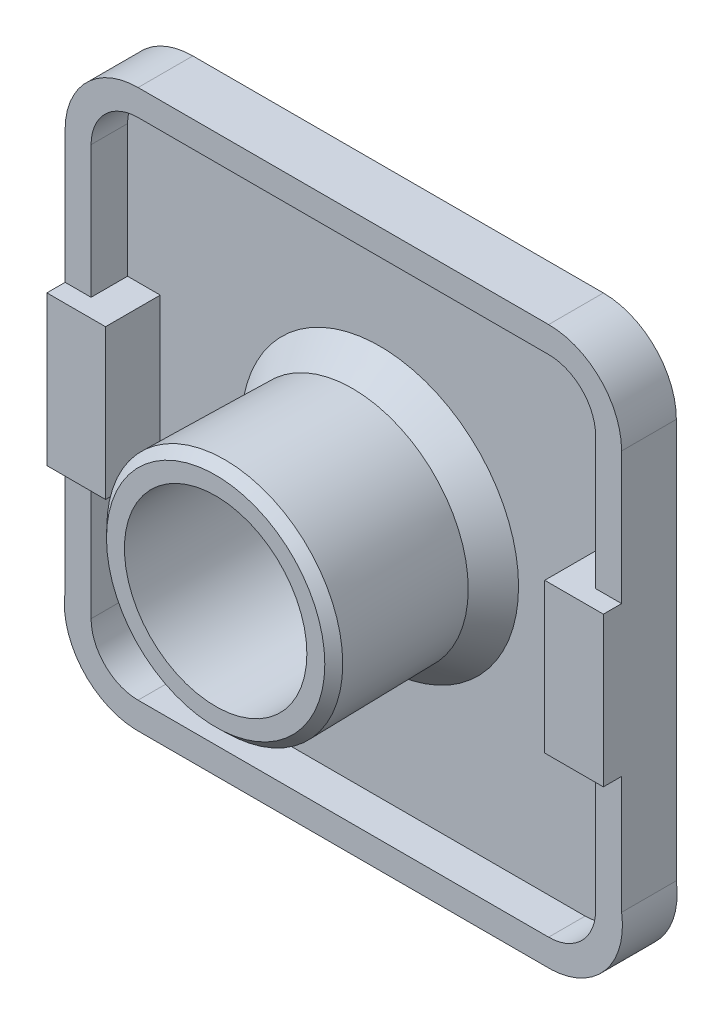
ISO-10303-21;
HEADER;
FILE_DESCRIPTION(('STEP AP214'),'2;1');
FILE_NAME('part.step','',(''),(''),'','','');
FILE_SCHEMA(('AUTOMOTIVE_DESIGN { 1 0 10303 214 1 1 1 1 }'));
ENDSEC;
DATA;
#1=APPLICATION_CONTEXT('core data for automotive mechanical design processes');
#2=APPLICATION_PROTOCOL_DEFINITION('international standard','automotive_design',2000,#1);
#3=PRODUCT_CONTEXT('',#1,'mechanical');
#4=PRODUCT('Part','Part','',(#3));
#5=PRODUCT_RELATED_PRODUCT_CATEGORY('part','',(#4));
#6=PRODUCT_DEFINITION_FORMATION('','',#4);
#7=PRODUCT_DEFINITION_CONTEXT('part definition',#1,'design');
#8=PRODUCT_DEFINITION('design','',#6,#7);
#9=PRODUCT_DEFINITION_SHAPE('','',#8);
#10=(LENGTH_UNIT() NAMED_UNIT(*) SI_UNIT(.MILLI.,.METRE.));
#11=(NAMED_UNIT(*) PLANE_ANGLE_UNIT() SI_UNIT($,.RADIAN.));
#12=(NAMED_UNIT(*) SI_UNIT($,.STERADIAN.) SOLID_ANGLE_UNIT());
#13=UNCERTAINTY_MEASURE_WITH_UNIT(LENGTH_MEASURE(1.E-05),#10,'distance_accuracy_value','');
#14=(GEOMETRIC_REPRESENTATION_CONTEXT(3) GLOBAL_UNCERTAINTY_ASSIGNED_CONTEXT((#13)) GLOBAL_UNIT_ASSIGNED_CONTEXT((#10,
#11,#12)) REPRESENTATION_CONTEXT('',''));
#15=CARTESIAN_POINT('',(0.,0.,0.));
#16=DIRECTION('',(0.,0.,1.));
#17=DIRECTION('',(1.,0.,0.));
#18=AXIS2_PLACEMENT_3D('',#15,#16,#17);
#19=CARTESIAN_POINT('',(0.,0.,3.));
#20=DIRECTION('',(0.,0.,1.));
#21=DIRECTION('',(1.,0.,0.));
#22=AXIS2_PLACEMENT_3D('',#19,#20,#21);
#23=PLANE('',#22);
#24=DIRECTION('',(0.,-1.,0.));
#25=VECTOR('',#24,1.);
#26=CARTESIAN_POINT('',(13.8269751195046,0.,3.));
#27=LINE('',#26,#25);
#28=CARTESIAN_POINT('',(13.8269751195046,11.25,3.));
#29=VERTEX_POINT('',#28);
#30=CARTESIAN_POINT('',(13.8269751195046,4.00484314294316,3.));
#31=VERTEX_POINT('',#30);
#32=EDGE_CURVE('E286',#29,#31,#27,.T.);
#33=ORIENTED_EDGE('',*,*,#32,.T.);
#34=DIRECTION('',(1.,0.,0.));
#35=VECTOR('',#34,1.);
#36=CARTESIAN_POINT('',(0.,4.00484314294315,3.));
#37=LINE('',#36,#35);
#38=CARTESIAN_POINT('',(15.25,4.00484314294316,3.));
#39=VERTEX_POINT('',#38);
#40=EDGE_CURVE('E449',#31,#39,#37,.T.);
#41=ORIENTED_EDGE('',*,*,#40,.T.);
#42=DIRECTION('',(0.,-1.,0.));
#43=VECTOR('',#42,1.);
#44=CARTESIAN_POINT('',(15.25,0.,3.));
#45=LINE('',#44,#43);
#46=CARTESIAN_POINT('',(15.25,11.25,3.));
#47=VERTEX_POINT('',#46);
#48=EDGE_CURVE('E299',#47,#39,#45,.T.);
#49=ORIENTED_EDGE('',*,*,#48,.F.);
#50=CARTESIAN_POINT('',(11.25,11.25,3.));
#51=DIRECTION('',(0.,0.,1.));
#52=DIRECTION('',(1.,0.,0.));
#53=AXIS2_PLACEMENT_3D('',#50,#51,#52);
#54=CIRCLE('',#53,4.);
#55=CARTESIAN_POINT('',(11.25,15.25,3.));
#56=VERTEX_POINT('',#55);
#57=EDGE_CURVE('E302',#47,#56,#54,.T.);
#58=ORIENTED_EDGE('',*,*,#57,.T.);
#59=DIRECTION('',(-1.,0.,0.));
#60=VECTOR('',#59,1.);
#61=CARTESIAN_POINT('',(0.,15.25,3.));
#62=LINE('',#61,#60);
#63=CARTESIAN_POINT('',(-11.25,15.25,3.));
#64=VERTEX_POINT('',#63);
#65=EDGE_CURVE('E305',#56,#64,#62,.T.);
#66=ORIENTED_EDGE('',*,*,#65,.T.);
#67=CARTESIAN_POINT('',(-11.25,11.25,3.));
#68=DIRECTION('',(0.,0.,1.));
#69=DIRECTION('',(1.,0.,0.));
#70=AXIS2_PLACEMENT_3D('',#67,#68,#69);
#71=CIRCLE('',#70,4.);
#72=CARTESIAN_POINT('',(-15.25,11.25,3.));
#73=VERTEX_POINT('',#72);
#74=EDGE_CURVE('E308',#73,#64,#71,.F.);
#75=ORIENTED_EDGE('',*,*,#74,.F.);
#76=DIRECTION('',(0.,-1.,0.));
#77=VECTOR('',#76,1.);
#78=CARTESIAN_POINT('',(-15.25,0.,3.));
#79=LINE('',#78,#77);
#80=CARTESIAN_POINT('',(-15.25,4.00484314294316,3.));
#81=VERTEX_POINT('',#80);
#82=EDGE_CURVE('E312',#73,#81,#79,.T.);
#83=ORIENTED_EDGE('',*,*,#82,.T.);
#84=DIRECTION('',(-1.,0.,0.));
#85=VECTOR('',#84,1.);
#86=CARTESIAN_POINT('',(0.,4.00484314294315,3.));
#87=LINE('',#86,#85);
#88=CARTESIAN_POINT('',(-13.8269751195046,4.00484314294316,3.));
#89=VERTEX_POINT('',#88);
#90=EDGE_CURVE('E445',#89,#81,#87,.T.);
#91=ORIENTED_EDGE('',*,*,#90,.F.);
#92=DIRECTION('',(0.,-1.,0.));
#93=VECTOR('',#92,1.);
#94=CARTESIAN_POINT('',(-13.8269751195046,0.,3.));
#95=LINE('',#94,#93);
#96=CARTESIAN_POINT('',(-13.8269751195046,11.25,3.));
#97=VERTEX_POINT('',#96);
#98=EDGE_CURVE('E275',#97,#89,#95,.T.);
#99=ORIENTED_EDGE('',*,*,#98,.F.);
#100=CARTESIAN_POINT('',(-11.25,11.25,3.));
#101=DIRECTION('',(0.,0.,1.));
#102=DIRECTION('',(1.,0.,0.));
#103=AXIS2_PLACEMENT_3D('',#100,#101,#102);
#104=CIRCLE('',#103,2.57697511950461);
#105=CARTESIAN_POINT('',(-11.25,13.8269751195046,3.));
#106=VERTEX_POINT('',#105);
#107=EDGE_CURVE('E278',#97,#106,#104,.F.);
#108=ORIENTED_EDGE('',*,*,#107,.T.);
#109=DIRECTION('',(-1.,0.,0.));
#110=VECTOR('',#109,1.);
#111=CARTESIAN_POINT('',(0.,13.8269751195046,3.));
#112=LINE('',#111,#110);
#113=CARTESIAN_POINT('',(11.25,13.8269751195046,3.));
#114=VERTEX_POINT('',#113);
#115=EDGE_CURVE('E280',#114,#106,#112,.T.);
#116=ORIENTED_EDGE('',*,*,#115,.F.);
#117=CARTESIAN_POINT('',(11.25,11.25,3.));
#118=DIRECTION('',(0.,0.,1.));
#119=DIRECTION('',(1.,0.,0.));
#120=AXIS2_PLACEMENT_3D('',#117,#118,#119);
#121=CIRCLE('',#120,2.57697511950461);
#122=EDGE_CURVE('E283',#29,#114,#121,.T.);
#123=ORIENTED_EDGE('',*,*,#122,.F.);
#124=EDGE_LOOP('',(#33,#41,#49,#58,#66,#75,#83,#91,#99,#108,#116,#123));
#125=FACE_BOUND('',#124,.T.);
#126=ADVANCED_FACE('F36',(#125),#23,.T.);
#127=CARTESIAN_POINT('',(0.,0.,1.));
#128=DIRECTION('',(0.,0.,1.));
#129=DIRECTION('',(1.,0.,0.));
#130=AXIS2_PLACEMENT_3D('',#127,#128,#129);
#131=PLANE('',#130);
#132=CARTESIAN_POINT('',(0.,0.,1.));
#133=DIRECTION('',(0.,0.,1.));
#134=DIRECTION('',(1.,0.,0.));
#135=AXIS2_PLACEMENT_3D('',#132,#133,#134);
#136=CIRCLE('',#135,7.60209142294292);
#137=CARTESIAN_POINT('',(7.60209142294292,0.,1.));
#138=VERTEX_POINT('',#137);
#139=EDGE_CURVE('E44',#138,#138,#136,.F.);
#140=ORIENTED_EDGE('',*,*,#139,.T.);
#141=EDGE_LOOP('',(#140));
#142=FACE_BOUND('',#141,.T.);
#143=DIRECTION('',(0.,1.,0.));
#144=VECTOR('',#143,1.);
#145=CARTESIAN_POINT('',(-13.8269751195046,0.,1.));
#146=LINE('',#145,#144);
#147=CARTESIAN_POINT('',(-13.8269751195046,-11.25,1.));
#148=VERTEX_POINT('',#147);
#149=CARTESIAN_POINT('',(-13.8269751195046,-4.19515685705684,1.));
#150=VERTEX_POINT('',#149);
#151=EDGE_CURVE('E400',#148,#150,#146,.T.);
#152=ORIENTED_EDGE('',*,*,#151,.F.);
#153=CARTESIAN_POINT('',(-11.25,-11.25,1.));
#154=DIRECTION('',(0.,0.,1.));
#155=DIRECTION('',(1.,0.,0.));
#156=AXIS2_PLACEMENT_3D('',#153,#154,#155);
#157=CIRCLE('',#156,2.57697511950461);
#158=CARTESIAN_POINT('',(-11.25,-13.8269751195046,1.));
#159=VERTEX_POINT('',#158);
#160=EDGE_CURVE('E365',#159,#148,#157,.F.);
#161=ORIENTED_EDGE('',*,*,#160,.F.);
#162=DIRECTION('',(1.,0.,0.));
#163=VECTOR('',#162,1.);
#164=CARTESIAN_POINT('',(0.,-13.8269751195046,1.));
#165=LINE('',#164,#163);
#166=CARTESIAN_POINT('',(11.25,-13.8269751195046,1.));
#167=VERTEX_POINT('',#166);
#168=EDGE_CURVE('E368',#159,#167,#165,.T.);
#169=ORIENTED_EDGE('',*,*,#168,.T.);
#170=CARTESIAN_POINT('',(11.25,-11.25,1.));
#171=DIRECTION('',(0.,0.,1.));
#172=DIRECTION('',(1.,0.,0.));
#173=AXIS2_PLACEMENT_3D('',#170,#171,#172);
#174=CIRCLE('',#173,2.57697511950461);
#175=CARTESIAN_POINT('',(13.8269751195046,-11.25,1.));
#176=VERTEX_POINT('',#175);
#177=EDGE_CURVE('E370',#167,#176,#174,.T.);
#178=ORIENTED_EDGE('',*,*,#177,.T.);
#179=DIRECTION('',(0.,1.,0.));
#180=VECTOR('',#179,1.);
#181=CARTESIAN_POINT('',(13.8269751195046,0.,1.));
#182=LINE('',#181,#180);
#183=CARTESIAN_POINT('',(13.8269751195046,-4.19515685705684,1.));
#184=VERTEX_POINT('',#183);
#185=EDGE_CURVE('E372',#176,#184,#182,.T.);
#186=ORIENTED_EDGE('',*,*,#185,.T.);
#187=DIRECTION('',(1.,0.,0.));
#188=VECTOR('',#187,1.);
#189=CARTESIAN_POINT('',(0.,-4.19515685705684,1.));
#190=LINE('',#189,#188);
#191=CARTESIAN_POINT('',(12.0358307471212,-4.19515685705684,1.));
#192=VERTEX_POINT('',#191);
#193=EDGE_CURVE('E374',#192,#184,#190,.T.);
#194=ORIENTED_EDGE('',*,*,#193,.F.);
#195=DIRECTION('',(0.,1.,0.));
#196=VECTOR('',#195,1.);
#197=CARTESIAN_POINT('',(12.0358307471212,0.,1.));
#198=LINE('',#197,#196);
#199=CARTESIAN_POINT('',(12.0358307471212,4.00484314294316,1.));
#200=VERTEX_POINT('',#199);
#201=EDGE_CURVE('E377',#192,#200,#198,.T.);
#202=ORIENTED_EDGE('',*,*,#201,.T.);
#203=DIRECTION('',(1.,0.,0.));
#204=VECTOR('',#203,1.);
#205=CARTESIAN_POINT('',(0.,4.00484314294315,1.));
#206=LINE('',#205,#204);
#207=CARTESIAN_POINT('',(13.8269751195046,4.00484314294316,1.));
#208=VERTEX_POINT('',#207);
#209=EDGE_CURVE('E228',#200,#208,#206,.T.);
#210=ORIENTED_EDGE('',*,*,#209,.T.);
#211=DIRECTION('',(0.,1.,0.));
#212=VECTOR('',#211,1.);
#213=CARTESIAN_POINT('',(13.8269751195046,0.,1.));
#214=LINE('',#213,#212);
#215=CARTESIAN_POINT('',(13.8269751195046,11.25,1.));
#216=VERTEX_POINT('',#215);
#217=EDGE_CURVE('E380',#208,#216,#214,.T.);
#218=ORIENTED_EDGE('',*,*,#217,.T.);
#219=CARTESIAN_POINT('',(11.25,11.25,1.));
#220=DIRECTION('',(0.,0.,1.));
#221=DIRECTION('',(1.,0.,0.));
#222=AXIS2_PLACEMENT_3D('',#219,#220,#221);
#223=CIRCLE('',#222,2.57697511950461);
#224=CARTESIAN_POINT('',(11.25,13.8269751195046,1.));
#225=VERTEX_POINT('',#224);
#226=EDGE_CURVE('E382',#225,#216,#223,.F.);
#227=ORIENTED_EDGE('',*,*,#226,.F.);
#228=DIRECTION('',(1.,0.,0.));
#229=VECTOR('',#228,1.);
#230=CARTESIAN_POINT('',(0.,13.8269751195046,1.));
#231=LINE('',#230,#229);
#232=CARTESIAN_POINT('',(-11.25,13.8269751195046,1.));
#233=VERTEX_POINT('',#232);
#234=EDGE_CURVE('E385',#233,#225,#231,.T.);
#235=ORIENTED_EDGE('',*,*,#234,.F.);
#236=CARTESIAN_POINT('',(-11.25,11.25,1.));
#237=DIRECTION('',(0.,0.,1.));
#238=DIRECTION('',(1.,0.,0.));
#239=AXIS2_PLACEMENT_3D('',#236,#237,#238);
#240=CIRCLE('',#239,2.57697511950461);
#241=CARTESIAN_POINT('',(-13.8269751195046,11.25,1.));
#242=VERTEX_POINT('',#241);
#243=EDGE_CURVE('E388',#233,#242,#240,.T.);
#244=ORIENTED_EDGE('',*,*,#243,.T.);
#245=DIRECTION('',(0.,1.,0.));
#246=VECTOR('',#245,1.);
#247=CARTESIAN_POINT('',(-13.8269751195046,0.,1.));
#248=LINE('',#247,#246);
#249=CARTESIAN_POINT('',(-13.8269751195046,4.00484314294316,1.));
#250=VERTEX_POINT('',#249);
#251=EDGE_CURVE('E390',#250,#242,#248,.T.);
#252=ORIENTED_EDGE('',*,*,#251,.F.);
#253=DIRECTION('',(-1.,0.,0.));
#254=VECTOR('',#253,1.);
#255=CARTESIAN_POINT('',(0.,4.00484314294315,1.));
#256=LINE('',#255,#254);
#257=CARTESIAN_POINT('',(-12.0358307471212,4.00484314294316,1.));
#258=VERTEX_POINT('',#257);
#259=EDGE_CURVE('E393',#258,#250,#256,.T.);
#260=ORIENTED_EDGE('',*,*,#259,.F.);
#261=DIRECTION('',(0.,1.,0.));
#262=VECTOR('',#261,1.);
#263=CARTESIAN_POINT('',(-12.0358307471212,0.,1.));
#264=LINE('',#263,#262);
#265=CARTESIAN_POINT('',(-12.0358307471212,-4.19515685705684,1.));
#266=VERTEX_POINT('',#265);
#267=EDGE_CURVE('E396',#266,#258,#264,.T.);
#268=ORIENTED_EDGE('',*,*,#267,.F.);
#269=DIRECTION('',(-1.,0.,0.));
#270=VECTOR('',#269,1.);
#271=CARTESIAN_POINT('',(0.,-4.19515685705684,1.));
#272=LINE('',#271,#270);
#273=EDGE_CURVE('E59',#266,#150,#272,.T.);
#274=ORIENTED_EDGE('',*,*,#273,.T.);
#275=EDGE_LOOP('',(#152,#161,#169,#178,#186,#194,#202,#210,#218,#227,#235,#244,#252,#260,#268,#274));
#276=FACE_BOUND('',#275,.T.);
#277=ADVANCED_FACE('F466',(#142,#276),#131,.T.);
#278=CARTESIAN_POINT('',(-15.25,0.,1.));
#279=DIRECTION('',(1.,0.,0.));
#280=DIRECTION('',(0.,1.,0.));
#281=AXIS2_PLACEMENT_3D('',#278,#279,#280);
#282=PLANE('',#281);
#283=DIRECTION('',(0.,-1.,0.));
#284=VECTOR('',#283,1.);
#285=CARTESIAN_POINT('',(-15.25,0.,0.));
#286=LINE('',#285,#284);
#287=CARTESIAN_POINT('',(-15.25,11.25,0.));
#288=VERTEX_POINT('',#287);
#289=CARTESIAN_POINT('',(-15.25,-10.65,0.));
#290=VERTEX_POINT('',#289);
#291=EDGE_CURVE('E402',#288,#290,#286,.T.);
#292=ORIENTED_EDGE('',*,*,#291,.T.);
#293=DIRECTION('',(0.,0.,-1.));
#294=VECTOR('',#293,1.);
#295=CARTESIAN_POINT('',(-15.25,-10.65,1.));
#296=LINE('',#295,#294);
#297=CARTESIAN_POINT('',(-15.25,-10.65,3.));
#298=VERTEX_POINT('',#297);
#299=EDGE_CURVE('E439',#298,#290,#296,.T.);
#300=ORIENTED_EDGE('',*,*,#299,.F.);
#301=CARTESIAN_POINT('',(-15.25,-4.19515685705684,3.));
#302=VERTEX_POINT('',#301);
#303=EDGE_CURVE('E311',#302,#298,#79,.T.);
#304=ORIENTED_EDGE('',*,*,#303,.F.);
#305=DIRECTION('',(0.,0.,-1.));
#306=VECTOR('',#305,1.);
#307=CARTESIAN_POINT('',(-15.25,-4.19515685705684,4.));
#308=LINE('',#307,#306);
#309=CARTESIAN_POINT('',(-15.25,-4.19515685705684,4.));
#310=VERTEX_POINT('',#309);
#311=EDGE_CURVE('E267',#310,#302,#308,.T.);
#312=ORIENTED_EDGE('',*,*,#311,.F.);
#313=DIRECTION('',(0.,-1.,0.));
#314=VECTOR('',#313,1.);
#315=CARTESIAN_POINT('',(-15.25,0.,4.));
#316=LINE('',#315,#314);
#317=CARTESIAN_POINT('',(-15.25,4.00484314294316,4.));
#318=VERTEX_POINT('',#317);
#319=EDGE_CURVE('E259',#318,#310,#316,.T.);
#320=ORIENTED_EDGE('',*,*,#319,.F.);
#321=DIRECTION('',(0.,0.,-1.));
#322=VECTOR('',#321,1.);
#323=CARTESIAN_POINT('',(-15.25,4.00484314294316,4.));
#324=LINE('',#323,#322);
#325=EDGE_CURVE('E269',#318,#81,#324,.T.);
#326=ORIENTED_EDGE('',*,*,#325,.T.);
#327=ORIENTED_EDGE('',*,*,#82,.F.);
#328=DIRECTION('',(0.,0.,-1.));
#329=VECTOR('',#328,1.);
#330=CARTESIAN_POINT('',(-15.25,11.25,1.));
#331=LINE('',#330,#329);
#332=EDGE_CURVE('E423',#73,#288,#331,.T.);
#333=ORIENTED_EDGE('',*,*,#332,.T.);
#334=EDGE_LOOP('',(#292,#300,#304,#312,#320,#326,#327,#333));
#335=FACE_BOUND('',#334,.T.);
#336=ADVANCED_FACE('F484',(#335),#282,.F.);
#337=CARTESIAN_POINT('',(-11.25,-11.25,1.));
#338=DIRECTION('',(0.,0.,-1.));
#339=DIRECTION('',(-1.,0.,0.));
#340=AXIS2_PLACEMENT_3D('',#337,#338,#339);
#341=CYLINDRICAL_SURFACE('',#340,4.04474968323134);
#342=CARTESIAN_POINT('',(-11.25,-11.25,0.));
#343=DIRECTION('',(0.,0.,1.));
#344=DIRECTION('',(1.,0.,0.));
#345=AXIS2_PLACEMENT_3D('',#342,#343,#344);
#346=CIRCLE('',#345,4.04474968323134);
#347=CARTESIAN_POINT('',(-11.4066556147709,-15.2917148610906,0.));
#348=VERTEX_POINT('',#347);
#349=EDGE_CURVE('E404',#348,#290,#346,.F.);
#350=ORIENTED_EDGE('',*,*,#349,.F.);
#351=DIRECTION('',(0.,0.,-1.));
#352=VECTOR('',#351,1.);
#353=CARTESIAN_POINT('',(-11.4066556147709,-15.2917148610906,1.));
#354=LINE('',#353,#352);
#355=CARTESIAN_POINT('',(-11.4066556147709,-15.2917148610906,3.));
#356=VERTEX_POINT('',#355);
#357=EDGE_CURVE('E437',#356,#348,#354,.T.);
#358=ORIENTED_EDGE('',*,*,#357,.F.);
#359=CARTESIAN_POINT('',(-11.25,-11.25,3.));
#360=DIRECTION('',(0.,0.,1.));
#361=DIRECTION('',(1.,0.,0.));
#362=AXIS2_PLACEMENT_3D('',#359,#360,#361);
#363=CIRCLE('',#362,4.04474968323134);
#364=EDGE_CURVE('E315',#356,#298,#363,.F.);
#365=ORIENTED_EDGE('',*,*,#364,.T.);
#366=ORIENTED_EDGE('',*,*,#299,.T.);
#367=EDGE_LOOP('',(#350,#358,#365,#366));
#368=FACE_BOUND('',#367,.T.);
#369=ADVANCED_FACE('F534',(#368),#341,.T.);
#370=CARTESIAN_POINT('',(0.,-15.2917148610906,1.));
#371=DIRECTION('',(0.,-1.,0.));
#372=DIRECTION('',(0.,0.,-1.));
#373=AXIS2_PLACEMENT_3D('',#370,#371,#372);
#374=PLANE('',#373);
#375=DIRECTION('',(-1.,0.,0.));
#376=VECTOR('',#375,1.);
#377=CARTESIAN_POINT('',(0.,-15.2917148610906,0.));
#378=LINE('',#377,#376);
#379=CARTESIAN_POINT('',(11.4066556147709,-15.2917148610906,0.));
#380=VERTEX_POINT('',#379);
#381=EDGE_CURVE('E407',#380,#348,#378,.T.);
#382=ORIENTED_EDGE('',*,*,#381,.F.);
#383=DIRECTION('',(0.,0.,-1.));
#384=VECTOR('',#383,1.);
#385=CARTESIAN_POINT('',(11.4066556147709,-15.2917148610906,1.));
#386=LINE('',#385,#384);
#387=CARTESIAN_POINT('',(11.4066556147709,-15.2917148610906,3.));
#388=VERTEX_POINT('',#387);
#389=EDGE_CURVE('E435',#388,#380,#386,.T.);
#390=ORIENTED_EDGE('',*,*,#389,.F.);
#391=DIRECTION('',(-1.,0.,0.));
#392=VECTOR('',#391,1.);
#393=CARTESIAN_POINT('',(0.,-15.2917148610906,3.));
#394=LINE('',#393,#392);
#395=EDGE_CURVE('E318',#388,#356,#394,.T.);
#396=ORIENTED_EDGE('',*,*,#395,.T.);
#397=ORIENTED_EDGE('',*,*,#357,.T.);
#398=EDGE_LOOP('',(#382,#390,#396,#397));
#399=FACE_BOUND('',#398,.T.);
#400=ADVANCED_FACE('F538',(#399),#374,.T.);
#401=CARTESIAN_POINT('',(11.25,-11.25,1.));
#402=DIRECTION('',(0.,0.,-1.));
#403=DIRECTION('',(-1.,0.,0.));
#404=AXIS2_PLACEMENT_3D('',#401,#402,#403);
#405=CYLINDRICAL_SURFACE('',#404,4.04474968323134);
#406=CARTESIAN_POINT('',(11.25,-11.25,0.));
#407=DIRECTION('',(0.,0.,1.));
#408=DIRECTION('',(1.,0.,0.));
#409=AXIS2_PLACEMENT_3D('',#406,#407,#408);
#410=CIRCLE('',#409,4.04474968323134);
#411=CARTESIAN_POINT('',(15.25,-10.65,0.));
#412=VERTEX_POINT('',#411);
#413=EDGE_CURVE('E410',#380,#412,#410,.T.);
#414=ORIENTED_EDGE('',*,*,#413,.T.);
#415=DIRECTION('',(0.,0.,-1.));
#416=VECTOR('',#415,1.);
#417=CARTESIAN_POINT('',(15.25,-10.65,1.));
#418=LINE('',#417,#416);
#419=CARTESIAN_POINT('',(15.25,-10.65,3.));
#420=VERTEX_POINT('',#419);
#421=EDGE_CURVE('E432',#420,#412,#418,.T.);
#422=ORIENTED_EDGE('',*,*,#421,.F.);
#423=CARTESIAN_POINT('',(11.25,-11.25,3.));
#424=DIRECTION('',(0.,0.,1.));
#425=DIRECTION('',(1.,0.,0.));
#426=AXIS2_PLACEMENT_3D('',#423,#424,#425);
#427=CIRCLE('',#426,4.04474968323134);
#428=EDGE_CURVE('E321',#388,#420,#427,.T.);
#429=ORIENTED_EDGE('',*,*,#428,.F.);
#430=ORIENTED_EDGE('',*,*,#389,.T.);
#431=EDGE_LOOP('',(#414,#422,#429,#430));
#432=FACE_BOUND('',#431,.T.);
#433=ADVANCED_FACE('F543',(#432),#405,.T.);
#434=CARTESIAN_POINT('',(15.25,0.,1.));
#435=DIRECTION('',(1.,0.,0.));
#436=DIRECTION('',(0.,1.,0.));
#437=AXIS2_PLACEMENT_3D('',#434,#435,#436);
#438=PLANE('',#437);
#439=ORIENTED_EDGE('',*,*,#421,.T.);
#440=DIRECTION('',(0.,-1.,0.));
#441=VECTOR('',#440,1.);
#442=CARTESIAN_POINT('',(15.25,0.,0.));
#443=LINE('',#442,#441);
#444=CARTESIAN_POINT('',(15.25,11.25,0.));
#445=VERTEX_POINT('',#444);
#446=EDGE_CURVE('E413',#445,#412,#443,.T.);
#447=ORIENTED_EDGE('',*,*,#446,.F.);
#448=DIRECTION('',(0.,0.,-1.));
#449=VECTOR('',#448,1.);
#450=CARTESIAN_POINT('',(15.25,11.25,1.));
#451=LINE('',#450,#449);
#452=EDGE_CURVE('E430',#47,#445,#451,.T.);
#453=ORIENTED_EDGE('',*,*,#452,.F.);
#454=ORIENTED_EDGE('',*,*,#48,.T.);
#455=DIRECTION('',(0.,0.,-1.));
#456=VECTOR('',#455,1.);
#457=CARTESIAN_POINT('',(15.25,4.00484314294316,4.));
#458=LINE('',#457,#456);
#459=CARTESIAN_POINT('',(15.25,4.00484314294316,4.));
#460=VERTEX_POINT('',#459);
#461=EDGE_CURVE('E253',#460,#39,#458,.T.);
#462=ORIENTED_EDGE('',*,*,#461,.F.);
#463=DIRECTION('',(0.,1.,0.));
#464=VECTOR('',#463,1.);
#465=CARTESIAN_POINT('',(15.25,0.,4.));
#466=LINE('',#465,#464);
#467=CARTESIAN_POINT('',(15.25,-4.19515685705684,4.));
#468=VERTEX_POINT('',#467);
#469=EDGE_CURVE('E244',#468,#460,#466,.T.);
#470=ORIENTED_EDGE('',*,*,#469,.F.);
#471=DIRECTION('',(0.,0.,-1.));
#472=VECTOR('',#471,1.);
#473=CARTESIAN_POINT('',(15.25,-4.19515685705684,4.));
#474=LINE('',#473,#472);
#475=CARTESIAN_POINT('',(15.25,-4.19515685705684,3.));
#476=VERTEX_POINT('',#475);
#477=EDGE_CURVE('E51',#468,#476,#474,.T.);
#478=ORIENTED_EDGE('',*,*,#477,.T.);
#479=EDGE_CURVE('E298',#476,#420,#45,.T.);
#480=ORIENTED_EDGE('',*,*,#479,.T.);
#481=EDGE_LOOP('',(#439,#447,#453,#454,#462,#470,#478,#480));
#482=FACE_BOUND('',#481,.T.);
#483=ADVANCED_FACE('F545',(#482),#438,.T.);
#484=CARTESIAN_POINT('',(11.25,11.25,1.));
#485=DIRECTION('',(0.,0.,-1.));
#486=DIRECTION('',(-1.,0.,0.));
#487=AXIS2_PLACEMENT_3D('',#484,#485,#486);
#488=CYLINDRICAL_SURFACE('',#487,4.);
#489=CARTESIAN_POINT('',(11.25,11.25,0.));
#490=DIRECTION('',(0.,0.,1.));
#491=DIRECTION('',(1.,0.,0.));
#492=AXIS2_PLACEMENT_3D('',#489,#490,#491);
#493=CIRCLE('',#492,4.);
#494=CARTESIAN_POINT('',(11.25,15.25,0.));
#495=VERTEX_POINT('',#494);
#496=EDGE_CURVE('E415',#445,#495,#493,.T.);
#497=ORIENTED_EDGE('',*,*,#496,.T.);
#498=DIRECTION('',(0.,0.,-1.));
#499=VECTOR('',#498,1.);
#500=CARTESIAN_POINT('',(11.25,15.25,1.));
#501=LINE('',#500,#499);
#502=EDGE_CURVE('E427',#56,#495,#501,.T.);
#503=ORIENTED_EDGE('',*,*,#502,.F.);
#504=ORIENTED_EDGE('',*,*,#57,.F.);
#505=ORIENTED_EDGE('',*,*,#452,.T.);
#506=EDGE_LOOP('',(#497,#503,#504,#505));
#507=FACE_BOUND('',#506,.T.);
#508=ADVANCED_FACE('F552',(#507),#488,.T.);
#509=CARTESIAN_POINT('',(0.,15.25,1.));
#510=DIRECTION('',(0.,-1.,0.));
#511=DIRECTION('',(1.,0.,0.));
#512=AXIS2_PLACEMENT_3D('',#509,#510,#511);
#513=PLANE('',#512);
#514=DIRECTION('',(-1.,0.,0.));
#515=VECTOR('',#514,1.);
#516=CARTESIAN_POINT('',(0.,15.25,0.));
#517=LINE('',#516,#515);
#518=CARTESIAN_POINT('',(-11.25,15.25,0.));
#519=VERTEX_POINT('',#518);
#520=EDGE_CURVE('E417',#495,#519,#517,.T.);
#521=ORIENTED_EDGE('',*,*,#520,.T.);
#522=DIRECTION('',(0.,0.,-1.));
#523=VECTOR('',#522,1.);
#524=CARTESIAN_POINT('',(-11.25,15.25,1.));
#525=LINE('',#524,#523);
#526=EDGE_CURVE('E425',#64,#519,#525,.T.);
#527=ORIENTED_EDGE('',*,*,#526,.F.);
#528=ORIENTED_EDGE('',*,*,#65,.F.);
#529=ORIENTED_EDGE('',*,*,#502,.T.);
#530=EDGE_LOOP('',(#521,#527,#528,#529));
#531=FACE_BOUND('',#530,.T.);
#532=ADVANCED_FACE('F555',(#531),#513,.F.);
#533=CARTESIAN_POINT('',(-11.25,11.25,1.));
#534=DIRECTION('',(0.,0.,-1.));
#535=DIRECTION('',(-1.,0.,0.));
#536=AXIS2_PLACEMENT_3D('',#533,#534,#535);
#537=CYLINDRICAL_SURFACE('',#536,4.);
#538=CARTESIAN_POINT('',(-11.25,11.25,0.));
#539=DIRECTION('',(0.,0.,1.));
#540=DIRECTION('',(1.,0.,0.));
#541=AXIS2_PLACEMENT_3D('',#538,#539,#540);
#542=CIRCLE('',#541,4.);
#543=EDGE_CURVE('E420',#288,#519,#542,.F.);
#544=ORIENTED_EDGE('',*,*,#543,.F.);
#545=ORIENTED_EDGE('',*,*,#332,.F.);
#546=ORIENTED_EDGE('',*,*,#74,.T.);
#547=ORIENTED_EDGE('',*,*,#526,.T.);
#548=EDGE_LOOP('',(#544,#545,#546,#547));
#549=FACE_BOUND('',#548,.T.);
#550=ADVANCED_FACE('F590',(#549),#537,.T.);
#551=CARTESIAN_POINT('',(0.,0.,0.));
#552=DIRECTION('',(0.,0.,1.));
#553=DIRECTION('',(1.,0.,0.));
#554=AXIS2_PLACEMENT_3D('',#551,#552,#553);
#555=PLANE('',#554);
#556=ORIENTED_EDGE('',*,*,#446,.T.);
#557=ORIENTED_EDGE('',*,*,#413,.F.);
#558=ORIENTED_EDGE('',*,*,#381,.T.);
#559=ORIENTED_EDGE('',*,*,#349,.T.);
#560=ORIENTED_EDGE('',*,*,#291,.F.);
#561=ORIENTED_EDGE('',*,*,#543,.T.);
#562=ORIENTED_EDGE('',*,*,#520,.F.);
#563=ORIENTED_EDGE('',*,*,#496,.F.);
#564=EDGE_LOOP('',(#556,#557,#558,#559,#560,#561,#562,#563));
#565=FACE_BOUND('',#564,.T.);
#566=ADVANCED_FACE('F549',(#565),#555,.F.);
#567=CARTESIAN_POINT('',(-13.8269751195046,0.,3.));
#568=DIRECTION('',(1.,0.,0.));
#569=DIRECTION('',(0.,0.,-1.));
#570=AXIS2_PLACEMENT_3D('',#567,#568,#569);
#571=PLANE('',#570);
#572=DIRECTION('',(0.,0.,-1.));
#573=VECTOR('',#572,1.);
#574=CARTESIAN_POINT('',(-13.8269751195046,-11.25,3.));
#575=LINE('',#574,#573);
#576=CARTESIAN_POINT('',(-13.8269751195046,-11.25,3.));
#577=VERTEX_POINT('',#576);
#578=EDGE_CURVE('E324',#577,#148,#575,.T.);
#579=ORIENTED_EDGE('',*,*,#578,.T.);
#580=ORIENTED_EDGE('',*,*,#151,.T.);
#581=DIRECTION('',(0.,0.,-1.));
#582=VECTOR('',#581,1.);
#583=CARTESIAN_POINT('',(-13.8269751195046,-4.19515685705684,3.));
#584=LINE('',#583,#582);
#585=CARTESIAN_POINT('',(-13.8269751195046,-4.19515685705684,3.));
#586=VERTEX_POINT('',#585);
#587=EDGE_CURVE('E362',#586,#150,#584,.T.);
#588=ORIENTED_EDGE('',*,*,#587,.F.);
#589=DIRECTION('',(0.,-1.,0.));
#590=VECTOR('',#589,1.);
#591=CARTESIAN_POINT('',(-13.8269751195046,0.,3.));
#592=LINE('',#591,#590);
#593=EDGE_CURVE('E272',#586,#577,#592,.T.);
#594=ORIENTED_EDGE('',*,*,#593,.T.);
#595=EDGE_LOOP('',(#579,#580,#588,#594));
#596=FACE_BOUND('',#595,.T.);
#597=ADVANCED_FACE('F522',(#596),#571,.T.);
#598=CARTESIAN_POINT('',(0.,-4.19515685705684,3.));
#599=DIRECTION('',(0.,1.,0.));
#600=DIRECTION('',(-1.,0.,0.));
#601=AXIS2_PLACEMENT_3D('',#598,#599,#600);
#602=PLANE('',#601);
#603=ORIENTED_EDGE('',*,*,#273,.F.);
#604=DIRECTION('',(0.,0.,-1.));
#605=VECTOR('',#604,1.);
#606=CARTESIAN_POINT('',(-12.0358307471212,-4.19515685705684,3.));
#607=LINE('',#606,#605);
#608=CARTESIAN_POINT('',(-12.0358307471212,-4.19515685705684,4.));
#609=VERTEX_POINT('',#608);
#610=EDGE_CURVE('E359',#609,#266,#607,.T.);
#611=ORIENTED_EDGE('',*,*,#610,.F.);
#612=DIRECTION('',(1.,0.,0.));
#613=VECTOR('',#612,1.);
#614=CARTESIAN_POINT('',(0.,-4.19515685705684,4.));
#615=LINE('',#614,#613);
#616=EDGE_CURVE('E261',#310,#609,#615,.T.);
#617=ORIENTED_EDGE('',*,*,#616,.F.);
#618=ORIENTED_EDGE('',*,*,#311,.T.);
#619=DIRECTION('',(-1.,0.,0.));
#620=VECTOR('',#619,1.);
#621=CARTESIAN_POINT('',(0.,-4.19515685705684,3.));
#622=LINE('',#621,#620);
#623=EDGE_CURVE('E442',#586,#302,#622,.T.);
#624=ORIENTED_EDGE('',*,*,#623,.F.);
#625=ORIENTED_EDGE('',*,*,#587,.T.);
#626=EDGE_LOOP('',(#603,#611,#617,#618,#624,#625));
#627=FACE_BOUND('',#626,.T.);
#628=ADVANCED_FACE('F583',(#627),#602,.F.);
#629=CARTESIAN_POINT('',(-12.0358307471212,0.,3.));
#630=DIRECTION('',(1.,0.,0.));
#631=DIRECTION('',(0.,0.,-1.));
#632=AXIS2_PLACEMENT_3D('',#629,#630,#631);
#633=PLANE('',#632);
#634=ORIENTED_EDGE('',*,*,#610,.T.);
#635=ORIENTED_EDGE('',*,*,#267,.T.);
#636=DIRECTION('',(0.,0.,-1.));
#637=VECTOR('',#636,1.);
#638=CARTESIAN_POINT('',(-12.0358307471212,4.00484314294316,3.));
#639=LINE('',#638,#637);
#640=CARTESIAN_POINT('',(-12.0358307471212,4.00484314294316,4.));
#641=VERTEX_POINT('',#640);
#642=EDGE_CURVE('E356',#641,#258,#639,.T.);
#643=ORIENTED_EDGE('',*,*,#642,.F.);
#644=DIRECTION('',(0.,-1.,0.));
#645=VECTOR('',#644,1.);
#646=CARTESIAN_POINT('',(-12.0358307471212,0.,4.));
#647=LINE('',#646,#645);
#648=EDGE_CURVE('E264',#641,#609,#647,.T.);
#649=ORIENTED_EDGE('',*,*,#648,.T.);
#650=EDGE_LOOP('',(#634,#635,#643,#649));
#651=FACE_BOUND('',#650,.T.);
#652=ADVANCED_FACE('F581',(#651),#633,.T.);
#653=CARTESIAN_POINT('',(0.,4.00484314294315,3.));
#654=DIRECTION('',(0.,1.,0.));
#655=DIRECTION('',(-1.,0.,0.));
#656=AXIS2_PLACEMENT_3D('',#653,#654,#655);
#657=PLANE('',#656);
#658=ORIENTED_EDGE('',*,*,#642,.T.);
#659=ORIENTED_EDGE('',*,*,#259,.T.);
#660=DIRECTION('',(0.,0.,-1.));
#661=VECTOR('',#660,1.);
#662=CARTESIAN_POINT('',(-13.8269751195046,4.00484314294316,3.));
#663=LINE('',#662,#661);
#664=EDGE_CURVE('E353',#89,#250,#663,.T.);
#665=ORIENTED_EDGE('',*,*,#664,.F.);
#666=ORIENTED_EDGE('',*,*,#90,.T.);
#667=ORIENTED_EDGE('',*,*,#325,.F.);
#668=DIRECTION('',(1.,0.,0.));
#669=VECTOR('',#668,1.);
#670=CARTESIAN_POINT('',(0.,4.00484314294315,4.));
#671=LINE('',#670,#669);
#672=EDGE_CURVE('E256',#318,#641,#671,.T.);
#673=ORIENTED_EDGE('',*,*,#672,.T.);
#674=EDGE_LOOP('',(#658,#659,#665,#666,#667,#673));
#675=FACE_BOUND('',#674,.T.);
#676=ADVANCED_FACE('F579',(#675),#657,.T.);
#677=CARTESIAN_POINT('',(-13.8269751195046,0.,3.));
#678=DIRECTION('',(1.,0.,0.));
#679=DIRECTION('',(0.,0.,-1.));
#680=AXIS2_PLACEMENT_3D('',#677,#678,#679);
#681=PLANE('',#680);
#682=ORIENTED_EDGE('',*,*,#664,.T.);
#683=ORIENTED_EDGE('',*,*,#251,.T.);
#684=DIRECTION('',(0.,0.,-1.));
#685=VECTOR('',#684,1.);
#686=CARTESIAN_POINT('',(-13.8269751195046,11.25,3.));
#687=LINE('',#686,#685);
#688=EDGE_CURVE('E350',#97,#242,#687,.T.);
#689=ORIENTED_EDGE('',*,*,#688,.F.);
#690=ORIENTED_EDGE('',*,*,#98,.T.);
#691=EDGE_LOOP('',(#682,#683,#689,#690));
#692=FACE_BOUND('',#691,.T.);
#693=ADVANCED_FACE('F576',(#692),#681,.T.);
#694=CARTESIAN_POINT('',(-11.25,11.25,3.));
#695=DIRECTION('',(0.,0.,-1.));
#696=DIRECTION('',(-1.,0.,0.));
#697=AXIS2_PLACEMENT_3D('',#694,#695,#696);
#698=CYLINDRICAL_SURFACE('',#697,2.57697511950461);
#699=ORIENTED_EDGE('',*,*,#243,.F.);
#700=DIRECTION('',(0.,0.,-1.));
#701=VECTOR('',#700,1.);
#702=CARTESIAN_POINT('',(-11.25,13.8269751195046,3.));
#703=LINE('',#702,#701);
#704=EDGE_CURVE('E347',#106,#233,#703,.T.);
#705=ORIENTED_EDGE('',*,*,#704,.F.);
#706=ORIENTED_EDGE('',*,*,#107,.F.);
#707=ORIENTED_EDGE('',*,*,#688,.T.);
#708=EDGE_LOOP('',(#699,#705,#706,#707));
#709=FACE_BOUND('',#708,.T.);
#710=ADVANCED_FACE('F574',(#709),#698,.F.);
#711=CARTESIAN_POINT('',(0.,13.8269751195046,3.));
#712=DIRECTION('',(0.,-1.,0.));
#713=DIRECTION('',(0.,0.,-1.));
#714=AXIS2_PLACEMENT_3D('',#711,#712,#713);
#715=PLANE('',#714);
#716=ORIENTED_EDGE('',*,*,#704,.T.);
#717=ORIENTED_EDGE('',*,*,#234,.T.);
#718=DIRECTION('',(0.,0.,-1.));
#719=VECTOR('',#718,1.);
#720=CARTESIAN_POINT('',(11.25,13.8269751195046,3.));
#721=LINE('',#720,#719);
#722=EDGE_CURVE('E344',#114,#225,#721,.T.);
#723=ORIENTED_EDGE('',*,*,#722,.F.);
#724=ORIENTED_EDGE('',*,*,#115,.T.);
#725=EDGE_LOOP('',(#716,#717,#723,#724));
#726=FACE_BOUND('',#725,.T.);
#727=ADVANCED_FACE('F568',(#726),#715,.T.);
#728=CARTESIAN_POINT('',(11.25,11.25,3.));
#729=DIRECTION('',(0.,0.,-1.));
#730=DIRECTION('',(-1.,0.,0.));
#731=AXIS2_PLACEMENT_3D('',#728,#729,#730);
#732=CYLINDRICAL_SURFACE('',#731,2.57697511950461);
#733=ORIENTED_EDGE('',*,*,#722,.T.);
#734=ORIENTED_EDGE('',*,*,#226,.T.);
#735=DIRECTION('',(0.,0.,-1.));
#736=VECTOR('',#735,1.);
#737=CARTESIAN_POINT('',(13.8269751195046,11.25,3.));
#738=LINE('',#737,#736);
#739=EDGE_CURVE('E341',#29,#216,#738,.T.);
#740=ORIENTED_EDGE('',*,*,#739,.F.);
#741=ORIENTED_EDGE('',*,*,#122,.T.);
#742=EDGE_LOOP('',(#733,#734,#740,#741));
#743=FACE_BOUND('',#742,.T.);
#744=ADVANCED_FACE('F566',(#743),#732,.F.);
#745=CARTESIAN_POINT('',(13.8269751195046,0.,3.));
#746=DIRECTION('',(1.,0.,0.));
#747=DIRECTION('',(0.,0.,-1.));
#748=AXIS2_PLACEMENT_3D('',#745,#746,#747);
#749=PLANE('',#748);
#750=ORIENTED_EDGE('',*,*,#217,.F.);
#751=DIRECTION('',(0.,0.,-1.));
#752=VECTOR('',#751,1.);
#753=CARTESIAN_POINT('',(13.8269751195046,4.00484314294316,3.));
#754=LINE('',#753,#752);
#755=EDGE_CURVE('E231',#31,#208,#754,.T.);
#756=ORIENTED_EDGE('',*,*,#755,.F.);
#757=ORIENTED_EDGE('',*,*,#32,.F.);
#758=ORIENTED_EDGE('',*,*,#739,.T.);
#759=EDGE_LOOP('',(#750,#756,#757,#758));
#760=FACE_BOUND('',#759,.T.);
#761=ADVANCED_FACE('F564',(#760),#749,.F.);
#762=CARTESIAN_POINT('',(0.,4.00484314294315,3.));
#763=DIRECTION('',(0.,-1.,0.));
#764=DIRECTION('',(1.,0.,0.));
#765=AXIS2_PLACEMENT_3D('',#762,#763,#764);
#766=PLANE('',#765);
#767=ORIENTED_EDGE('',*,*,#209,.F.);
#768=DIRECTION('',(0.,0.,-1.));
#769=VECTOR('',#768,1.);
#770=CARTESIAN_POINT('',(12.0358307471212,4.00484314294316,3.));
#771=LINE('',#770,#769);
#772=CARTESIAN_POINT('',(12.0358307471212,4.00484314294316,4.));
#773=VERTEX_POINT('',#772);
#774=EDGE_CURVE('E222',#773,#200,#771,.T.);
#775=ORIENTED_EDGE('',*,*,#774,.F.);
#776=DIRECTION('',(-1.,0.,0.));
#777=VECTOR('',#776,1.);
#778=CARTESIAN_POINT('',(0.,4.00484314294315,4.));
#779=LINE('',#778,#777);
#780=EDGE_CURVE('E226',#460,#773,#779,.T.);
#781=ORIENTED_EDGE('',*,*,#780,.F.);
#782=ORIENTED_EDGE('',*,*,#461,.T.);
#783=ORIENTED_EDGE('',*,*,#40,.F.);
#784=ORIENTED_EDGE('',*,*,#755,.T.);
#785=EDGE_LOOP('',(#767,#775,#781,#782,#783,#784));
#786=FACE_BOUND('',#785,.T.);
#787=ADVANCED_FACE('F224',(#786),#766,.F.);
#788=CARTESIAN_POINT('',(12.0358307471212,0.,3.));
#789=DIRECTION('',(1.,0.,0.));
#790=DIRECTION('',(0.,0.,-1.));
#791=AXIS2_PLACEMENT_3D('',#788,#789,#790);
#792=PLANE('',#791);
#793=ORIENTED_EDGE('',*,*,#201,.F.);
#794=DIRECTION('',(0.,0.,-1.));
#795=VECTOR('',#794,1.);
#796=CARTESIAN_POINT('',(12.0358307471212,-4.19515685705684,3.));
#797=LINE('',#796,#795);
#798=CARTESIAN_POINT('',(12.0358307471212,-4.19515685705684,4.));
#799=VERTEX_POINT('',#798);
#800=EDGE_CURVE('E232',#799,#192,#797,.T.);
#801=ORIENTED_EDGE('',*,*,#800,.F.);
#802=DIRECTION('',(0.,-1.,0.));
#803=VECTOR('',#802,1.);
#804=CARTESIAN_POINT('',(12.0358307471212,0.,4.));
#805=LINE('',#804,#803);
#806=EDGE_CURVE('E235',#773,#799,#805,.T.);
#807=ORIENTED_EDGE('',*,*,#806,.F.);
#808=ORIENTED_EDGE('',*,*,#774,.T.);
#809=EDGE_LOOP('',(#793,#801,#807,#808));
#810=FACE_BOUND('',#809,.T.);
#811=ADVANCED_FACE('F236',(#810),#792,.F.);
#812=CARTESIAN_POINT('',(0.,-4.19515685705684,3.));
#813=DIRECTION('',(0.,-1.,0.));
#814=DIRECTION('',(1.,0.,0.));
#815=AXIS2_PLACEMENT_3D('',#812,#813,#814);
#816=PLANE('',#815);
#817=ORIENTED_EDGE('',*,*,#800,.T.);
#818=ORIENTED_EDGE('',*,*,#193,.T.);
#819=DIRECTION('',(0.,0.,-1.));
#820=VECTOR('',#819,1.);
#821=CARTESIAN_POINT('',(13.8269751195046,-4.19515685705684,3.));
#822=LINE('',#821,#820);
#823=CARTESIAN_POINT('',(13.8269751195046,-4.19515685705684,3.));
#824=VERTEX_POINT('',#823);
#825=EDGE_CURVE('E336',#824,#184,#822,.T.);
#826=ORIENTED_EDGE('',*,*,#825,.F.);
#827=DIRECTION('',(1.,0.,0.));
#828=VECTOR('',#827,1.);
#829=CARTESIAN_POINT('',(0.,-4.19515685705684,3.));
#830=LINE('',#829,#828);
#831=EDGE_CURVE('E447',#824,#476,#830,.T.);
#832=ORIENTED_EDGE('',*,*,#831,.T.);
#833=ORIENTED_EDGE('',*,*,#477,.F.);
#834=DIRECTION('',(-1.,0.,0.));
#835=VECTOR('',#834,1.);
#836=CARTESIAN_POINT('',(0.,-4.19515685705684,4.));
#837=LINE('',#836,#835);
#838=EDGE_CURVE('E241',#468,#799,#837,.T.);
#839=ORIENTED_EDGE('',*,*,#838,.T.);
#840=EDGE_LOOP('',(#817,#818,#826,#832,#833,#839));
#841=FACE_BOUND('',#840,.T.);
#842=ADVANCED_FACE('F505',(#841),#816,.T.);
#843=CARTESIAN_POINT('',(13.8269751195046,0.,3.));
#844=DIRECTION('',(1.,0.,0.));
#845=DIRECTION('',(0.,0.,-1.));
#846=AXIS2_PLACEMENT_3D('',#843,#844,#845);
#847=PLANE('',#846);
#848=ORIENTED_EDGE('',*,*,#185,.F.);
#849=DIRECTION('',(0.,0.,-1.));
#850=VECTOR('',#849,1.);
#851=CARTESIAN_POINT('',(13.8269751195046,-11.25,3.));
#852=LINE('',#851,#850);
#853=CARTESIAN_POINT('',(13.8269751195046,-11.25,3.));
#854=VERTEX_POINT('',#853);
#855=EDGE_CURVE('E333',#854,#176,#852,.T.);
#856=ORIENTED_EDGE('',*,*,#855,.F.);
#857=DIRECTION('',(0.,-1.,0.));
#858=VECTOR('',#857,1.);
#859=CARTESIAN_POINT('',(13.8269751195046,0.,3.));
#860=LINE('',#859,#858);
#861=EDGE_CURVE('E289',#824,#854,#860,.T.);
#862=ORIENTED_EDGE('',*,*,#861,.F.);
#863=ORIENTED_EDGE('',*,*,#825,.T.);
#864=EDGE_LOOP('',(#848,#856,#862,#863));
#865=FACE_BOUND('',#864,.T.);
#866=ADVANCED_FACE('F508',(#865),#847,.F.);
#867=CARTESIAN_POINT('',(11.25,-11.25,3.));
#868=DIRECTION('',(0.,0.,-1.));
#869=DIRECTION('',(-1.,0.,0.));
#870=AXIS2_PLACEMENT_3D('',#867,#868,#869);
#871=CYLINDRICAL_SURFACE('',#870,2.57697511950461);
#872=ORIENTED_EDGE('',*,*,#177,.F.);
#873=DIRECTION('',(0.,0.,-1.));
#874=VECTOR('',#873,1.);
#875=CARTESIAN_POINT('',(11.25,-13.8269751195046,3.));
#876=LINE('',#875,#874);
#877=CARTESIAN_POINT('',(11.25,-13.8269751195046,3.));
#878=VERTEX_POINT('',#877);
#879=EDGE_CURVE('E330',#878,#167,#876,.T.);
#880=ORIENTED_EDGE('',*,*,#879,.F.);
#881=CARTESIAN_POINT('',(11.25,-11.25,3.));
#882=DIRECTION('',(0.,0.,1.));
#883=DIRECTION('',(1.,0.,0.));
#884=AXIS2_PLACEMENT_3D('',#881,#882,#883);
#885=CIRCLE('',#884,2.57697511950461);
#886=EDGE_CURVE('E291',#854,#878,#885,.F.);
#887=ORIENTED_EDGE('',*,*,#886,.F.);
#888=ORIENTED_EDGE('',*,*,#855,.T.);
#889=EDGE_LOOP('',(#872,#880,#887,#888));
#890=FACE_BOUND('',#889,.T.);
#891=ADVANCED_FACE('F513',(#890),#871,.F.);
#892=CARTESIAN_POINT('',(0.,-13.8269751195046,3.));
#893=DIRECTION('',(0.,-1.,0.));
#894=DIRECTION('',(0.,0.,-1.));
#895=AXIS2_PLACEMENT_3D('',#892,#893,#894);
#896=PLANE('',#895);
#897=ORIENTED_EDGE('',*,*,#168,.F.);
#898=DIRECTION('',(0.,0.,-1.));
#899=VECTOR('',#898,1.);
#900=CARTESIAN_POINT('',(-11.25,-13.8269751195046,3.));
#901=LINE('',#900,#899);
#902=CARTESIAN_POINT('',(-11.25,-13.8269751195046,3.));
#903=VERTEX_POINT('',#902);
#904=EDGE_CURVE('E327',#903,#159,#901,.T.);
#905=ORIENTED_EDGE('',*,*,#904,.F.);
#906=DIRECTION('',(-1.,0.,0.));
#907=VECTOR('',#906,1.);
#908=CARTESIAN_POINT('',(0.,-13.8269751195046,3.));
#909=LINE('',#908,#907);
#910=EDGE_CURVE('E293',#878,#903,#909,.T.);
#911=ORIENTED_EDGE('',*,*,#910,.F.);
#912=ORIENTED_EDGE('',*,*,#879,.T.);
#913=EDGE_LOOP('',(#897,#905,#911,#912));
#914=FACE_BOUND('',#913,.T.);
#915=ADVANCED_FACE('F498',(#914),#896,.F.);
#916=CARTESIAN_POINT('',(-11.25,-11.25,3.));
#917=DIRECTION('',(0.,0.,-1.));
#918=DIRECTION('',(-1.,0.,0.));
#919=AXIS2_PLACEMENT_3D('',#916,#917,#918);
#920=CYLINDRICAL_SURFACE('',#919,2.57697511950461);
#921=ORIENTED_EDGE('',*,*,#904,.T.);
#922=ORIENTED_EDGE('',*,*,#160,.T.);
#923=ORIENTED_EDGE('',*,*,#578,.F.);
#924=CARTESIAN_POINT('',(-11.25,-11.25,3.));
#925=DIRECTION('',(0.,0.,1.));
#926=DIRECTION('',(1.,0.,0.));
#927=AXIS2_PLACEMENT_3D('',#924,#925,#926);
#928=CIRCLE('',#927,2.57697511950461);
#929=EDGE_CURVE('E295',#577,#903,#928,.T.);
#930=ORIENTED_EDGE('',*,*,#929,.T.);
#931=EDGE_LOOP('',(#921,#922,#923,#930));
#932=FACE_BOUND('',#931,.T.);
#933=ADVANCED_FACE('F490',(#932),#920,.F.);
#934=ORIENTED_EDGE('',*,*,#831,.F.);
#935=ORIENTED_EDGE('',*,*,#861,.T.);
#936=ORIENTED_EDGE('',*,*,#886,.T.);
#937=ORIENTED_EDGE('',*,*,#910,.T.);
#938=ORIENTED_EDGE('',*,*,#929,.F.);
#939=ORIENTED_EDGE('',*,*,#593,.F.);
#940=ORIENTED_EDGE('',*,*,#623,.T.);
#941=ORIENTED_EDGE('',*,*,#303,.T.);
#942=ORIENTED_EDGE('',*,*,#364,.F.);
#943=ORIENTED_EDGE('',*,*,#395,.F.);
#944=ORIENTED_EDGE('',*,*,#428,.T.);
#945=ORIENTED_EDGE('',*,*,#479,.F.);
#946=EDGE_LOOP('',(#934,#935,#936,#937,#938,#939,#940,#941,#942,#943,#944,#945));
#947=FACE_BOUND('',#946,.T.);
#948=ADVANCED_FACE('F480',(#947),#23,.T.);
#949=CARTESIAN_POINT('',(0.,0.,0.));
#950=DIRECTION('',(0.,0.,1.));
#951=DIRECTION('',(1.,0.,0.));
#952=AXIS2_PLACEMENT_3D('',#949,#950,#951);
#953=CONICAL_SURFACE('',#952,6.3,0.0174532925199433);
#954=CARTESIAN_POINT('',(0.,0.,2.49977154273456));
#955=DIRECTION('',(0.,0.,-1.));
#956=DIRECTION('',(-1.,0.,0.));
#957=AXIS2_PLACEMENT_3D('',#954,#955,#956);
#958=CIRCLE('',#957,6.34363367458414);
#959=CARTESIAN_POINT('',(-6.34363367458414,0.,2.49977154273456));
#960=VERTEX_POINT('',#959);
#961=EDGE_CURVE('E11',#960,#960,#958,.F.);
#962=ORIENTED_EDGE('',*,*,#961,.T.);
#963=EDGE_LOOP('',(#962));
#964=FACE_BOUND('',#963,.T.);
#965=CARTESIAN_POINT('',(0.,0.,9.5000761524218));
#966=DIRECTION('',(0.,0.,1.));
#967=DIRECTION('',(1.,0.,0.));
#968=AXIS2_PLACEMENT_3D('',#965,#966,#967);
#969=CIRCLE('',#968,6.46582444606353);
#970=CARTESIAN_POINT('',(6.46582444606353,0.,9.5000761524218));
#971=VERTEX_POINT('',#970);
#972=EDGE_CURVE('E455',#971,#971,#969,.F.);
#973=ORIENTED_EDGE('',*,*,#972,.T.);
#974=EDGE_LOOP('',(#973));
#975=FACE_BOUND('',#974,.T.);
#976=ADVANCED_FACE('F489',(#964,#975),#953,.T.);
#977=CARTESIAN_POINT('',(0.,0.,10.));
#978=DIRECTION('',(0.,0.,1.));
#979=DIRECTION('',(1.,0.,0.));
#980=AXIS2_PLACEMENT_3D('',#977,#978,#979);
#981=PLANE('',#980);
#982=CARTESIAN_POINT('',(0.,0.,10.));
#983=DIRECTION('',(0.,0.,1.));
#984=DIRECTION('',(1.,0.,0.));
#985=AXIS2_PLACEMENT_3D('',#982,#983,#984);
#986=CIRCLE('',#985,5.);
#987=CARTESIAN_POINT('',(5.,0.,10.));
#988=VERTEX_POINT('',#987);
#989=EDGE_CURVE('E246',#988,#988,#986,.T.);
#990=ORIENTED_EDGE('',*,*,#989,.F.);
#991=EDGE_LOOP('',(#990));
#992=FACE_BOUND('',#991,.T.);
#993=CARTESIAN_POINT('',(0.,0.,10.));
#994=DIRECTION('',(0.,0.,1.));
#995=DIRECTION('',(1.,0.,0.));
#996=AXIS2_PLACEMENT_3D('',#993,#994,#995);
#997=CIRCLE('',#996,5.98305359819891);
#998=CARTESIAN_POINT('',(5.98305359819891,0.,10.));
#999=VERTEX_POINT('',#998);
#1000=EDGE_CURVE('E452',#999,#999,#997,.T.);
#1001=ORIENTED_EDGE('',*,*,#1000,.T.);
#1002=EDGE_LOOP('',(#1001));
#1003=FACE_BOUND('',#1002,.T.);
#1004=ADVANCED_FACE('F496',(#992,#1003),#981,.T.);
#1005=CARTESIAN_POINT('',(0.,0.,4.));
#1006=DIRECTION('',(0.,0.,1.));
#1007=DIRECTION('',(1.,0.,0.));
#1008=AXIS2_PLACEMENT_3D('',#1005,#1006,#1007);
#1009=PLANE('',#1008);
#1010=ORIENTED_EDGE('',*,*,#672,.F.);
#1011=ORIENTED_EDGE('',*,*,#319,.T.);
#1012=ORIENTED_EDGE('',*,*,#616,.T.);
#1013=ORIENTED_EDGE('',*,*,#648,.F.);
#1014=EDGE_LOOP('',(#1010,#1011,#1012,#1013));
#1015=FACE_BOUND('',#1014,.T.);
#1016=ADVANCED_FACE('F586',(#1015),#1009,.T.);
#1017=CARTESIAN_POINT('',(0.,0.,4.));
#1018=DIRECTION('',(0.,0.,1.));
#1019=DIRECTION('',(1.,0.,0.));
#1020=AXIS2_PLACEMENT_3D('',#1017,#1018,#1019);
#1021=PLANE('',#1020);
#1022=ORIENTED_EDGE('',*,*,#780,.T.);
#1023=ORIENTED_EDGE('',*,*,#806,.T.);
#1024=ORIENTED_EDGE('',*,*,#838,.F.);
#1025=ORIENTED_EDGE('',*,*,#469,.T.);
#1026=EDGE_LOOP('',(#1022,#1023,#1024,#1025));
#1027=FACE_BOUND('',#1026,.T.);
#1028=ADVANCED_FACE('F243',(#1027),#1021,.T.);
#1029=CARTESIAN_POINT('',(0.,0.,10.));
#1030=DIRECTION('',(0.,0.,-1.));
#1031=DIRECTION('',(-1.,0.,0.));
#1032=AXIS2_PLACEMENT_3D('',#1029,#1030,#1031);
#1033=CONICAL_SURFACE('',#1032,5.98305359819891,0.767944870877502);
#1034=ORIENTED_EDGE('',*,*,#972,.F.);
#1035=EDGE_LOOP('',(#1034));
#1036=FACE_BOUND('',#1035,.T.);
#1037=ORIENTED_EDGE('',*,*,#1000,.F.);
#1038=EDGE_LOOP('',(#1037));
#1039=FACE_BOUND('',#1038,.T.);
#1040=ADVANCED_FACE('F612',(#1036,#1039),#1033,.T.);
#1041=CARTESIAN_POINT('',(0.,0.,0.999999999999999));
#1042=DIRECTION('',(0.,0.,1.));
#1043=DIRECTION('',(1.,0.,0.));
#1044=AXIS2_PLACEMENT_3D('',#1041,#1042,#1043);
#1045=CYLINDRICAL_SURFACE('',#1044,5.);
#1046=CARTESIAN_POINT('',(0.,0.,2.49999999999999));
#1047=DIRECTION('',(0.,0.,1.));
#1048=DIRECTION('',(1.,0.,0.));
#1049=AXIS2_PLACEMENT_3D('',#1046,#1047,#1048);
#1050=CIRCLE('',#1049,5.);
#1051=CARTESIAN_POINT('',(5.,0.,2.49999999999999));
#1052=VERTEX_POINT('',#1051);
#1053=EDGE_CURVE('E461',#1052,#1052,#1050,.F.);
#1054=ORIENTED_EDGE('',*,*,#1053,.T.);
#1055=EDGE_LOOP('',(#1054));
#1056=FACE_BOUND('',#1055,.T.);
#1057=ORIENTED_EDGE('',*,*,#989,.T.);
#1058=EDGE_LOOP('',(#1057));
#1059=FACE_BOUND('',#1058,.T.);
#1060=ADVANCED_FACE('F614',(#1056,#1059),#1045,.F.);
#1061=CARTESIAN_POINT('',(0.,0.,0.999999999999999));
#1062=DIRECTION('',(0.,0.,1.));
#1063=DIRECTION('',(1.,0.,0.));
#1064=AXIS2_PLACEMENT_3D('',#1061,#1062,#1063);
#1065=PLANE('',#1064);
#1066=CARTESIAN_POINT('',(0.,0.,0.999999999999999));
#1067=DIRECTION('',(0.,0.,1.));
#1068=DIRECTION('',(1.,0.,0.));
#1069=AXIS2_PLACEMENT_3D('',#1066,#1067,#1068);
#1070=CIRCLE('',#1069,3.69606989327565);
#1071=CARTESIAN_POINT('',(3.69606989327565,0.,0.999999999999999));
#1072=VERTEX_POINT('',#1071);
#1073=EDGE_CURVE('E458',#1072,#1072,#1070,.T.);
#1074=ORIENTED_EDGE('',*,*,#1073,.T.);
#1075=EDGE_LOOP('',(#1074));
#1076=FACE_BOUND('',#1075,.T.);
#1077=ADVANCED_FACE('F474',(#1076),#1065,.T.);
#1078=CARTESIAN_POINT('',(0.,0.,0.999999999999999));
#1079=DIRECTION('',(0.,0.,1.));
#1080=DIRECTION('',(1.,0.,0.));
#1081=AXIS2_PLACEMENT_3D('',#1078,#1079,#1080);
#1082=CONICAL_SURFACE('',#1081,3.69606989327565,0.71558499331768);
#1083=ORIENTED_EDGE('',*,*,#1053,.F.);
#1084=EDGE_LOOP('',(#1083));
#1085=FACE_BOUND('',#1084,.T.);
#1086=ORIENTED_EDGE('',*,*,#1073,.F.);
#1087=EDGE_LOOP('',(#1086));
#1088=FACE_BOUND('',#1087,.T.);
#1089=ADVANCED_FACE('F469',(#1085,#1088),#1082,.F.);
#1090=CARTESIAN_POINT('',(0.,0.,1.));
#1091=DIRECTION('',(0.,0.,-1.));
#1092=DIRECTION('',(-1.,0.,0.));
#1093=AXIS2_PLACEMENT_3D('',#1090,#1091,#1092);
#1094=CONICAL_SURFACE('',#1093,7.60209142294292,0.698131700797738);
#1095=ORIENTED_EDGE('',*,*,#961,.F.);
#1096=EDGE_LOOP('',(#1095));
#1097=FACE_BOUND('',#1096,.T.);
#1098=ORIENTED_EDGE('',*,*,#139,.F.);
#1099=EDGE_LOOP('',(#1098));
#1100=FACE_BOUND('',#1099,.T.);
#1101=ADVANCED_FACE('F38',(#1097,#1100),#1094,.T.);
#1102=CLOSED_SHELL('',(#126,#277,#336,#369,#400,#433,#483,#508,#532,#550,#566,#597,#628,#652,
#676,#693,#710,#727,#744,#761,#787,#811,#842,#866,#891,#915,#933,#948,#976,#1004,#1016,#1028,
#1040,#1060,#1077,#1089,#1101));
#1103=MANIFOLD_SOLID_BREP('B2',#1102);
#1104=ADVANCED_BREP_SHAPE_REPRESENTATION('',(#18,#1103),#14);
#1105=SHAPE_DEFINITION_REPRESENTATION(#9,#1104);
ENDSEC;
END-ISO-10303-21;
